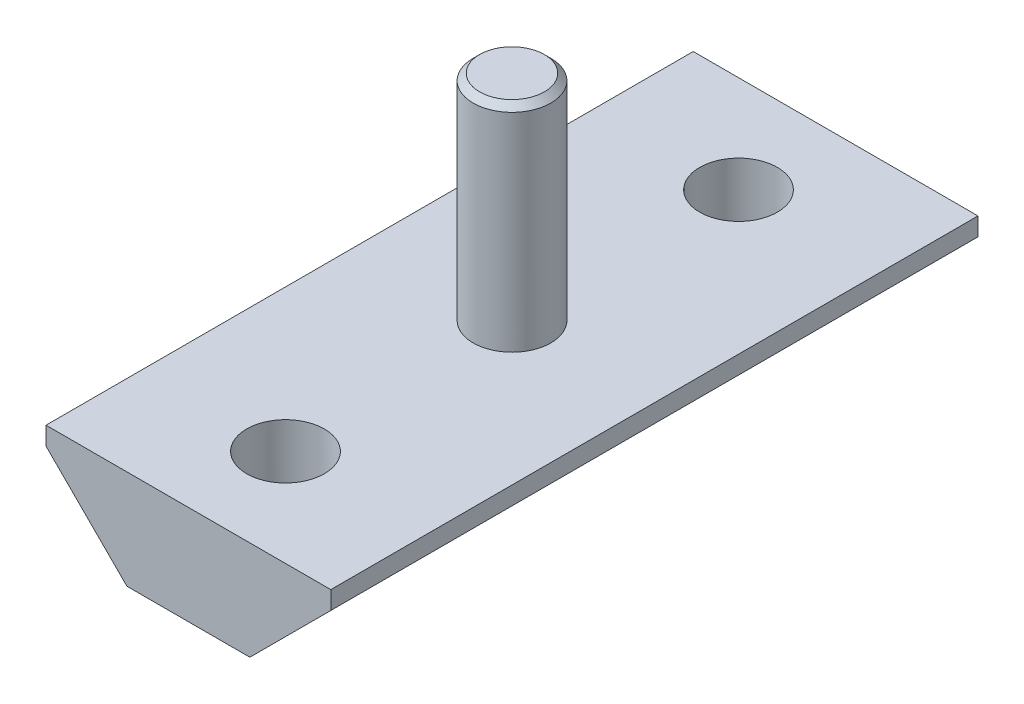
ISO-10303-21;
HEADER;
FILE_DESCRIPTION(('STEP AP214'),'2;1');
FILE_NAME('part.step','',(''),(''),'','','');
FILE_SCHEMA(('AUTOMOTIVE_DESIGN { 1 0 10303 214 1 1 1 1 }'));
ENDSEC;
DATA;
#1=APPLICATION_CONTEXT('core data for automotive mechanical design processes');
#2=APPLICATION_PROTOCOL_DEFINITION('international standard','automotive_design',2000,#1);
#3=PRODUCT_CONTEXT('',#1,'mechanical');
#4=PRODUCT('Part','Part','',(#3));
#5=PRODUCT_RELATED_PRODUCT_CATEGORY('part','',(#4));
#6=PRODUCT_DEFINITION_FORMATION('','',#4);
#7=PRODUCT_DEFINITION_CONTEXT('part definition',#1,'design');
#8=PRODUCT_DEFINITION('design','',#6,#7);
#9=PRODUCT_DEFINITION_SHAPE('','',#8);
#10=(LENGTH_UNIT() NAMED_UNIT(*) SI_UNIT(.MILLI.,.METRE.));
#11=(NAMED_UNIT(*) PLANE_ANGLE_UNIT() SI_UNIT($,.RADIAN.));
#12=(NAMED_UNIT(*) SI_UNIT($,.STERADIAN.) SOLID_ANGLE_UNIT());
#13=UNCERTAINTY_MEASURE_WITH_UNIT(LENGTH_MEASURE(1.E-05),#10,'distance_accuracy_value','');
#14=(GEOMETRIC_REPRESENTATION_CONTEXT(3) GLOBAL_UNCERTAINTY_ASSIGNED_CONTEXT((#13)) GLOBAL_UNIT_ASSIGNED_CONTEXT((#10,
#11,#12)) REPRESENTATION_CONTEXT('',''));
#15=CARTESIAN_POINT('',(0.,0.,0.));
#16=DIRECTION('',(0.,0.,1.));
#17=DIRECTION('',(1.,0.,0.));
#18=AXIS2_PLACEMENT_3D('',#15,#16,#17);
#19=CARTESIAN_POINT('',(-11.,7.65,25.));
#20=DIRECTION('',(1.,0.,0.));
#21=DIRECTION('',(0.,0.,-1.));
#22=AXIS2_PLACEMENT_3D('',#19,#20,#21);
#23=PLANE('',#22);
#24=DIRECTION('',(0.,-1.,0.));
#25=VECTOR('',#24,1.);
#26=CARTESIAN_POINT('',(-11.,7.65,-25.));
#27=LINE('',#26,#25);
#28=CARTESIAN_POINT('',(-11.,7.65,-25.));
#29=VERTEX_POINT('',#28);
#30=CARTESIAN_POINT('',(-11.,6.25,-25.));
#31=VERTEX_POINT('',#30);
#32=EDGE_CURVE('E122',#29,#31,#27,.T.);
#33=ORIENTED_EDGE('',*,*,#32,.T.);
#34=DIRECTION('',(0.,0.,-1.));
#35=VECTOR('',#34,1.);
#36=CARTESIAN_POINT('',(-11.,6.25,25.));
#37=LINE('',#36,#35);
#38=CARTESIAN_POINT('',(-11.,6.25,25.));
#39=VERTEX_POINT('',#38);
#40=EDGE_CURVE('E140',#39,#31,#37,.T.);
#41=ORIENTED_EDGE('',*,*,#40,.F.);
#42=DIRECTION('',(0.,-1.,0.));
#43=VECTOR('',#42,1.);
#44=CARTESIAN_POINT('',(-11.,7.65,25.));
#45=LINE('',#44,#43);
#46=CARTESIAN_POINT('',(-11.,7.65,25.));
#47=VERTEX_POINT('',#46);
#48=EDGE_CURVE('E133',#47,#39,#45,.T.);
#49=ORIENTED_EDGE('',*,*,#48,.F.);
#50=DIRECTION('',(0.,0.,-1.));
#51=VECTOR('',#50,1.);
#52=CARTESIAN_POINT('',(-11.,7.65,25.));
#53=LINE('',#52,#51);
#54=EDGE_CURVE('E118',#47,#29,#53,.T.);
#55=ORIENTED_EDGE('',*,*,#54,.T.);
#56=EDGE_LOOP('',(#33,#41,#49,#55));
#57=FACE_BOUND('',#56,.T.);
#58=ADVANCED_FACE('F35',(#57),#23,.F.);
#59=CARTESIAN_POINT('',(-11.,6.25,25.));
#60=DIRECTION('',(0.707106781186548,0.707106781186547,0.));
#61=DIRECTION('',(-0.707106781186547,0.707106781186548,0.));
#62=AXIS2_PLACEMENT_3D('',#59,#60,#61);
#63=PLANE('',#62);
#64=DIRECTION('',(0.707106781186547,-0.707106781186548,0.));
#65=VECTOR('',#64,1.);
#66=CARTESIAN_POINT('',(-11.,6.25,-25.));
#67=LINE('',#66,#65);
#68=CARTESIAN_POINT('',(-4.75,0.,-25.));
#69=VERTEX_POINT('',#68);
#70=EDGE_CURVE('E125',#31,#69,#67,.T.);
#71=ORIENTED_EDGE('',*,*,#70,.T.);
#72=DIRECTION('',(0.,0.,-1.));
#73=VECTOR('',#72,1.);
#74=CARTESIAN_POINT('',(-4.75,0.,25.));
#75=LINE('',#74,#73);
#76=CARTESIAN_POINT('',(-4.75,0.,25.));
#77=VERTEX_POINT('',#76);
#78=EDGE_CURVE('E137',#77,#69,#75,.T.);
#79=ORIENTED_EDGE('',*,*,#78,.F.);
#80=DIRECTION('',(0.707106781186547,-0.707106781186548,0.));
#81=VECTOR('',#80,1.);
#82=CARTESIAN_POINT('',(-11.,6.25,25.));
#83=LINE('',#82,#81);
#84=EDGE_CURVE('E91',#39,#77,#83,.T.);
#85=ORIENTED_EDGE('',*,*,#84,.F.);
#86=ORIENTED_EDGE('',*,*,#40,.T.);
#87=EDGE_LOOP('',(#71,#79,#85,#86));
#88=FACE_BOUND('',#87,.T.);
#89=ADVANCED_FACE('F160',(#88),#63,.F.);
#90=CARTESIAN_POINT('',(-4.75,0.,25.));
#91=DIRECTION('',(0.,1.,0.));
#92=DIRECTION('',(0.,0.,1.));
#93=AXIS2_PLACEMENT_3D('',#90,#91,#92);
#94=PLANE('',#93);
#95=CARTESIAN_POINT('',(0.,0.,-17.5));
#96=DIRECTION('',(0.,1.,0.));
#97=DIRECTION('',(0.,0.,1.));
#98=AXIS2_PLACEMENT_3D('',#95,#96,#97);
#99=CIRCLE('',#98,3.);
#100=CARTESIAN_POINT('',(0.,0.,-14.5));
#101=VERTEX_POINT('',#100);
#102=EDGE_CURVE('E126',#101,#101,#99,.T.);
#103=ORIENTED_EDGE('',*,*,#102,.T.);
#104=EDGE_LOOP('',(#103));
#105=FACE_BOUND('',#104,.T.);
#106=CARTESIAN_POINT('',(0.,0.,17.5));
#107=DIRECTION('',(0.,1.,0.));
#108=DIRECTION('',(0.,0.,1.));
#109=AXIS2_PLACEMENT_3D('',#106,#107,#108);
#110=CIRCLE('',#109,3.);
#111=CARTESIAN_POINT('',(0.,0.,20.5));
#112=VERTEX_POINT('',#111);
#113=EDGE_CURVE('E201',#112,#112,#110,.T.);
#114=ORIENTED_EDGE('',*,*,#113,.T.);
#115=EDGE_LOOP('',(#114));
#116=FACE_BOUND('',#115,.T.);
#117=DIRECTION('',(1.,0.,0.));
#118=VECTOR('',#117,1.);
#119=CARTESIAN_POINT('',(-4.75,0.,-25.));
#120=LINE('',#119,#118);
#121=CARTESIAN_POINT('',(4.75,0.,-25.));
#122=VERTEX_POINT('',#121);
#123=EDGE_CURVE('E128',#69,#122,#120,.T.);
#124=ORIENTED_EDGE('',*,*,#123,.T.);
#125=DIRECTION('',(0.,0.,-1.));
#126=VECTOR('',#125,1.);
#127=CARTESIAN_POINT('',(4.75,0.,25.));
#128=LINE('',#127,#126);
#129=CARTESIAN_POINT('',(4.75,0.,25.));
#130=VERTEX_POINT('',#129);
#131=EDGE_CURVE('E113',#130,#122,#128,.T.);
#132=ORIENTED_EDGE('',*,*,#131,.F.);
#133=DIRECTION('',(1.,0.,0.));
#134=VECTOR('',#133,1.);
#135=CARTESIAN_POINT('',(-4.75,0.,25.));
#136=LINE('',#135,#134);
#137=EDGE_CURVE('E104',#77,#130,#136,.T.);
#138=ORIENTED_EDGE('',*,*,#137,.F.);
#139=ORIENTED_EDGE('',*,*,#78,.T.);
#140=EDGE_LOOP('',(#124,#132,#138,#139));
#141=FACE_BOUND('',#140,.T.);
#142=ADVANCED_FACE('F165',(#105,#116,#141),#94,.F.);
#143=CARTESIAN_POINT('',(11.,6.25,25.));
#144=DIRECTION('',(-0.707106781186548,0.707106781186547,0.));
#145=DIRECTION('',(-0.707106781186547,-0.707106781186548,0.));
#146=AXIS2_PLACEMENT_3D('',#143,#144,#145);
#147=PLANE('',#146);
#148=DIRECTION('',(0.707106781186547,0.707106781186548,0.));
#149=VECTOR('',#148,1.);
#150=CARTESIAN_POINT('',(11.,6.25,-25.));
#151=LINE('',#150,#149);
#152=CARTESIAN_POINT('',(11.,6.25,-25.));
#153=VERTEX_POINT('',#152);
#154=EDGE_CURVE('E112',#122,#153,#151,.T.);
#155=ORIENTED_EDGE('',*,*,#154,.T.);
#156=DIRECTION('',(0.,0.,-1.));
#157=VECTOR('',#156,1.);
#158=CARTESIAN_POINT('',(11.,6.25,25.));
#159=LINE('',#158,#157);
#160=CARTESIAN_POINT('',(11.,6.25,25.));
#161=VERTEX_POINT('',#160);
#162=EDGE_CURVE('E109',#161,#153,#159,.T.);
#163=ORIENTED_EDGE('',*,*,#162,.F.);
#164=DIRECTION('',(0.707106781186547,0.707106781186548,0.));
#165=VECTOR('',#164,1.);
#166=CARTESIAN_POINT('',(11.,6.25,25.));
#167=LINE('',#166,#165);
#168=EDGE_CURVE('E98',#130,#161,#167,.T.);
#169=ORIENTED_EDGE('',*,*,#168,.F.);
#170=ORIENTED_EDGE('',*,*,#131,.T.);
#171=EDGE_LOOP('',(#155,#163,#169,#170));
#172=FACE_BOUND('',#171,.T.);
#173=ADVANCED_FACE('F110',(#172),#147,.F.);
#174=CARTESIAN_POINT('',(11.,7.65,25.));
#175=DIRECTION('',(-1.,0.,0.));
#176=DIRECTION('',(0.,0.,1.));
#177=AXIS2_PLACEMENT_3D('',#174,#175,#176);
#178=PLANE('',#177);
#179=DIRECTION('',(0.,1.,0.));
#180=VECTOR('',#179,1.);
#181=CARTESIAN_POINT('',(11.,7.65,-25.));
#182=LINE('',#181,#180);
#183=CARTESIAN_POINT('',(11.,7.65,-25.));
#184=VERTEX_POINT('',#183);
#185=EDGE_CURVE('E76',#153,#184,#182,.T.);
#186=ORIENTED_EDGE('',*,*,#185,.T.);
#187=DIRECTION('',(0.,0.,-1.));
#188=VECTOR('',#187,1.);
#189=CARTESIAN_POINT('',(11.,7.65,25.));
#190=LINE('',#189,#188);
#191=CARTESIAN_POINT('',(11.,7.65,25.));
#192=VERTEX_POINT('',#191);
#193=EDGE_CURVE('E114',#192,#184,#190,.T.);
#194=ORIENTED_EDGE('',*,*,#193,.F.);
#195=DIRECTION('',(0.,1.,0.));
#196=VECTOR('',#195,1.);
#197=CARTESIAN_POINT('',(11.,7.65,25.));
#198=LINE('',#197,#196);
#199=EDGE_CURVE('E102',#161,#192,#198,.T.);
#200=ORIENTED_EDGE('',*,*,#199,.F.);
#201=ORIENTED_EDGE('',*,*,#162,.T.);
#202=EDGE_LOOP('',(#186,#194,#200,#201));
#203=FACE_BOUND('',#202,.T.);
#204=ADVANCED_FACE('F116',(#203),#178,.F.);
#205=CARTESIAN_POINT('',(11.,7.65,25.));
#206=DIRECTION('',(0.,-1.,0.));
#207=DIRECTION('',(0.,0.,-1.));
#208=AXIS2_PLACEMENT_3D('',#205,#206,#207);
#209=PLANE('',#208);
#210=CARTESIAN_POINT('',(0.,7.65,-17.5));
#211=DIRECTION('',(0.,1.,0.));
#212=DIRECTION('',(0.,0.,1.));
#213=AXIS2_PLACEMENT_3D('',#210,#211,#212);
#214=CIRCLE('',#213,3.);
#215=CARTESIAN_POINT('',(0.,7.65,-14.5));
#216=VERTEX_POINT('',#215);
#217=EDGE_CURVE('E203',#216,#216,#214,.T.);
#218=ORIENTED_EDGE('',*,*,#217,.F.);
#219=EDGE_LOOP('',(#218));
#220=FACE_BOUND('',#219,.T.);
#221=CARTESIAN_POINT('',(0.,7.65,17.5));
#222=DIRECTION('',(0.,1.,0.));
#223=DIRECTION('',(0.,0.,-1.));
#224=AXIS2_PLACEMENT_3D('',#221,#222,#223);
#225=CIRCLE('',#224,3.);
#226=CARTESIAN_POINT('',(0.,7.65,14.5));
#227=VERTEX_POINT('',#226);
#228=EDGE_CURVE('E198',#227,#227,#225,.T.);
#229=ORIENTED_EDGE('',*,*,#228,.F.);
#230=EDGE_LOOP('',(#229));
#231=FACE_BOUND('',#230,.T.);
#232=CARTESIAN_POINT('',(0.,7.65,0.));
#233=DIRECTION('',(0.,-1.,0.));
#234=DIRECTION('',(0.,0.,-1.));
#235=AXIS2_PLACEMENT_3D('',#232,#233,#234);
#236=CIRCLE('',#235,3.);
#237=CARTESIAN_POINT('',(0.,7.65,-3.));
#238=VERTEX_POINT('',#237);
#239=EDGE_CURVE('E142',#238,#238,#236,.F.);
#240=ORIENTED_EDGE('',*,*,#239,.F.);
#241=EDGE_LOOP('',(#240));
#242=FACE_BOUND('',#241,.T.);
#243=DIRECTION('',(-1.,0.,0.));
#244=VECTOR('',#243,1.);
#245=CARTESIAN_POINT('',(11.,7.65,-25.));
#246=LINE('',#245,#244);
#247=EDGE_CURVE('E82',#184,#29,#246,.T.);
#248=ORIENTED_EDGE('',*,*,#247,.T.);
#249=ORIENTED_EDGE('',*,*,#54,.F.);
#250=DIRECTION('',(-1.,0.,0.));
#251=VECTOR('',#250,1.);
#252=CARTESIAN_POINT('',(11.,7.65,25.));
#253=LINE('',#252,#251);
#254=EDGE_CURVE('E53',#192,#47,#253,.T.);
#255=ORIENTED_EDGE('',*,*,#254,.F.);
#256=ORIENTED_EDGE('',*,*,#193,.T.);
#257=EDGE_LOOP('',(#248,#249,#255,#256));
#258=FACE_BOUND('',#257,.T.);
#259=ADVANCED_FACE('F175',(#220,#231,#242,#258),#209,.F.);
#260=CARTESIAN_POINT('',(0.,0.,25.));
#261=DIRECTION('',(0.,0.,1.));
#262=DIRECTION('',(1.,0.,0.));
#263=AXIS2_PLACEMENT_3D('',#260,#261,#262);
#264=PLANE('',#263);
#265=ORIENTED_EDGE('',*,*,#48,.T.);
#266=ORIENTED_EDGE('',*,*,#84,.T.);
#267=ORIENTED_EDGE('',*,*,#137,.T.);
#268=ORIENTED_EDGE('',*,*,#168,.T.);
#269=ORIENTED_EDGE('',*,*,#199,.T.);
#270=ORIENTED_EDGE('',*,*,#254,.T.);
#271=EDGE_LOOP('',(#265,#266,#267,#268,#269,#270));
#272=FACE_BOUND('',#271,.T.);
#273=ADVANCED_FACE('F100',(#272),#264,.T.);
#274=CARTESIAN_POINT('',(0.,0.,-25.));
#275=DIRECTION('',(0.,0.,1.));
#276=DIRECTION('',(1.,0.,0.));
#277=AXIS2_PLACEMENT_3D('',#274,#275,#276);
#278=PLANE('',#277);
#279=ORIENTED_EDGE('',*,*,#32,.F.);
#280=ORIENTED_EDGE('',*,*,#247,.F.);
#281=ORIENTED_EDGE('',*,*,#185,.F.);
#282=ORIENTED_EDGE('',*,*,#154,.F.);
#283=ORIENTED_EDGE('',*,*,#123,.F.);
#284=ORIENTED_EDGE('',*,*,#70,.F.);
#285=EDGE_LOOP('',(#279,#280,#281,#282,#283,#284));
#286=FACE_BOUND('',#285,.T.);
#287=ADVANCED_FACE('F179',(#286),#278,.F.);
#288=CARTESIAN_POINT('',(0.,24.2,0.));
#289=DIRECTION('',(0.,-1.,0.));
#290=DIRECTION('',(0.,0.,-1.));
#291=AXIS2_PLACEMENT_3D('',#288,#289,#290);
#292=CYLINDRICAL_SURFACE('',#291,3.);
#293=CARTESIAN_POINT('',(0.,23.7,0.));
#294=DIRECTION('',(0.,1.,0.));
#295=DIRECTION('',(0.,0.,1.));
#296=AXIS2_PLACEMENT_3D('',#293,#294,#295);
#297=CIRCLE('',#296,3.);
#298=CARTESIAN_POINT('',(0.,23.7,3.));
#299=VERTEX_POINT('',#298);
#300=EDGE_CURVE('E11',#299,#299,#297,.F.);
#301=ORIENTED_EDGE('',*,*,#300,.T.);
#302=EDGE_LOOP('',(#301));
#303=FACE_BOUND('',#302,.T.);
#304=ORIENTED_EDGE('',*,*,#239,.T.);
#305=EDGE_LOOP('',(#304));
#306=FACE_BOUND('',#305,.T.);
#307=ADVANCED_FACE('F182',(#303,#306),#292,.T.);
#308=CARTESIAN_POINT('',(0.,24.2,0.));
#309=DIRECTION('',(0.,1.,0.));
#310=DIRECTION('',(0.,0.,1.));
#311=AXIS2_PLACEMENT_3D('',#308,#309,#310);
#312=PLANE('',#311);
#313=CARTESIAN_POINT('',(0.,24.2,0.));
#314=DIRECTION('',(0.,1.,0.));
#315=DIRECTION('',(0.,0.,1.));
#316=AXIS2_PLACEMENT_3D('',#313,#314,#315);
#317=CIRCLE('',#316,2.5);
#318=CARTESIAN_POINT('',(0.,24.2,2.5));
#319=VERTEX_POINT('',#318);
#320=EDGE_CURVE('E45',#319,#319,#317,.T.);
#321=ORIENTED_EDGE('',*,*,#320,.T.);
#322=EDGE_LOOP('',(#321));
#323=FACE_BOUND('',#322,.T.);
#324=ADVANCED_FACE('F147',(#323),#312,.T.);
#325=CARTESIAN_POINT('',(0.,-2.35,17.5));
#326=DIRECTION('',(0.,1.,0.));
#327=DIRECTION('',(0.,0.,1.));
#328=AXIS2_PLACEMENT_3D('',#325,#326,#327);
#329=CYLINDRICAL_SURFACE('',#328,3.);
#330=ORIENTED_EDGE('',*,*,#228,.T.);
#331=EDGE_LOOP('',(#330));
#332=FACE_BOUND('',#331,.T.);
#333=ORIENTED_EDGE('',*,*,#113,.F.);
#334=EDGE_LOOP('',(#333));
#335=FACE_BOUND('',#334,.T.);
#336=ADVANCED_FACE('F155',(#332,#335),#329,.F.);
#337=CARTESIAN_POINT('',(0.,-2.35,-17.5));
#338=DIRECTION('',(0.,1.,0.));
#339=DIRECTION('',(0.,0.,1.));
#340=AXIS2_PLACEMENT_3D('',#337,#338,#339);
#341=CYLINDRICAL_SURFACE('',#340,3.);
#342=ORIENTED_EDGE('',*,*,#217,.T.);
#343=EDGE_LOOP('',(#342));
#344=FACE_BOUND('',#343,.T.);
#345=ORIENTED_EDGE('',*,*,#102,.F.);
#346=EDGE_LOOP('',(#345));
#347=FACE_BOUND('',#346,.T.);
#348=ADVANCED_FACE('F150',(#344,#347),#341,.F.);
#349=CARTESIAN_POINT('',(0.,24.2,0.));
#350=DIRECTION('',(0.,-1.,0.));
#351=DIRECTION('',(0.,0.,-1.));
#352=AXIS2_PLACEMENT_3D('',#349,#350,#351);
#353=CONICAL_SURFACE('',#352,2.5,0.785398163397446);
#354=ORIENTED_EDGE('',*,*,#300,.F.);
#355=EDGE_LOOP('',(#354));
#356=FACE_BOUND('',#355,.T.);
#357=ORIENTED_EDGE('',*,*,#320,.F.);
#358=EDGE_LOOP('',(#357));
#359=FACE_BOUND('',#358,.T.);
#360=ADVANCED_FACE('F38',(#356,#359),#353,.T.);
#361=CLOSED_SHELL('',(#58,#89,#142,#173,#204,#259,#273,#287,#307,#324,#336,#348,#360));
#362=MANIFOLD_SOLID_BREP('B2',#361);
#363=ADVANCED_BREP_SHAPE_REPRESENTATION('',(#18,#362),#14);
#364=SHAPE_DEFINITION_REPRESENTATION(#9,#363);
ENDSEC;
END-ISO-10303-21;
